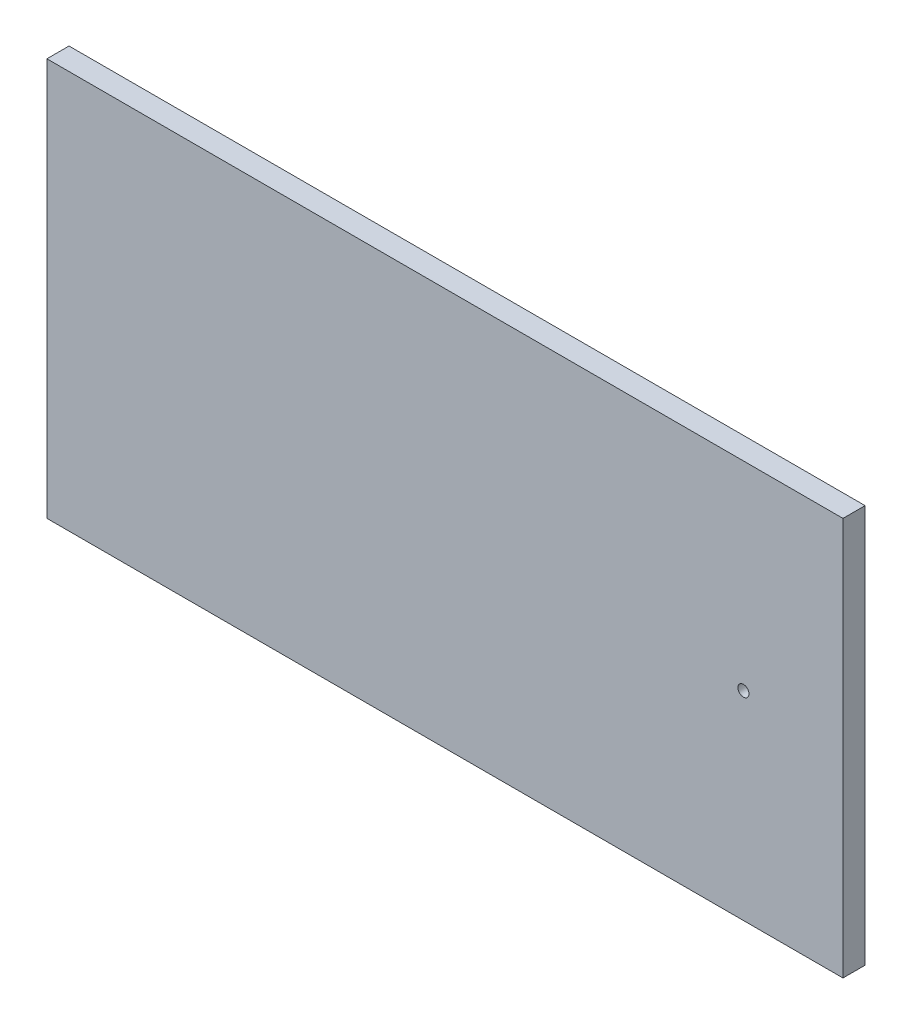
ISO-10303-21;
HEADER;
FILE_DESCRIPTION(('STEP AP214'),'2;1');
FILE_NAME('part.step','',(''),(''),'','','');
FILE_SCHEMA(('AUTOMOTIVE_DESIGN { 1 0 10303 214 1 1 1 1 }'));
ENDSEC;
DATA;
#1=APPLICATION_CONTEXT('core data for automotive mechanical design processes');
#2=APPLICATION_PROTOCOL_DEFINITION('international standard','automotive_design',2000,#1);
#3=PRODUCT_CONTEXT('',#1,'mechanical');
#4=PRODUCT('Part','Part','',(#3));
#5=PRODUCT_RELATED_PRODUCT_CATEGORY('part','',(#4));
#6=PRODUCT_DEFINITION_FORMATION('','',#4);
#7=PRODUCT_DEFINITION_CONTEXT('part definition',#1,'design');
#8=PRODUCT_DEFINITION('design','',#6,#7);
#9=PRODUCT_DEFINITION_SHAPE('','',#8);
#10=(LENGTH_UNIT() NAMED_UNIT(*) SI_UNIT(.MILLI.,.METRE.));
#11=(NAMED_UNIT(*) PLANE_ANGLE_UNIT() SI_UNIT($,.RADIAN.));
#12=(NAMED_UNIT(*) SI_UNIT($,.STERADIAN.) SOLID_ANGLE_UNIT());
#13=UNCERTAINTY_MEASURE_WITH_UNIT(LENGTH_MEASURE(1.E-05),#10,'distance_accuracy_value','');
#14=(GEOMETRIC_REPRESENTATION_CONTEXT(3) GLOBAL_UNCERTAINTY_ASSIGNED_CONTEXT((#13)) GLOBAL_UNIT_ASSIGNED_CONTEXT((#10,
#11,#12)) REPRESENTATION_CONTEXT('',''));
#15=CARTESIAN_POINT('',(0.,0.,0.));
#16=DIRECTION('',(0.,0.,1.));
#17=DIRECTION('',(1.,0.,0.));
#18=AXIS2_PLACEMENT_3D('',#15,#16,#17);
#19=CARTESIAN_POINT('',(0.,0.,12.7));
#20=DIRECTION('',(1.,0.,0.));
#21=DIRECTION('',(0.,1.,0.));
#22=AXIS2_PLACEMENT_3D('',#19,#20,#21);
#23=PLANE('',#22);
#24=DIRECTION('',(0.,-1.,0.));
#25=VECTOR('',#24,1.);
#26=CARTESIAN_POINT('',(0.,0.,0.));
#27=LINE('',#26,#25);
#28=CARTESIAN_POINT('',(0.,0.,0.));
#29=VERTEX_POINT('',#28);
#30=CARTESIAN_POINT('',(0.,-228.6,0.));
#31=VERTEX_POINT('',#30);
#32=EDGE_CURVE('E111',#29,#31,#27,.T.);
#33=ORIENTED_EDGE('',*,*,#32,.T.);
#34=DIRECTION('',(0.,0.,-1.));
#35=VECTOR('',#34,1.);
#36=CARTESIAN_POINT('',(0.,-228.6,12.7));
#37=LINE('',#36,#35);
#38=CARTESIAN_POINT('',(0.,-228.6,12.7));
#39=VERTEX_POINT('',#38);
#40=EDGE_CURVE('E11',#39,#31,#37,.T.);
#41=ORIENTED_EDGE('',*,*,#40,.F.);
#42=DIRECTION('',(0.,-1.,0.));
#43=VECTOR('',#42,1.);
#44=CARTESIAN_POINT('',(0.,0.,12.7));
#45=LINE('',#44,#43);
#46=CARTESIAN_POINT('',(0.,0.,12.7));
#47=VERTEX_POINT('',#46);
#48=EDGE_CURVE('E95',#47,#39,#45,.T.);
#49=ORIENTED_EDGE('',*,*,#48,.F.);
#50=DIRECTION('',(0.,0.,-1.));
#51=VECTOR('',#50,1.);
#52=CARTESIAN_POINT('',(0.,0.,12.7));
#53=LINE('',#52,#51);
#54=EDGE_CURVE('E107',#47,#29,#53,.T.);
#55=ORIENTED_EDGE('',*,*,#54,.T.);
#56=EDGE_LOOP('',(#33,#41,#49,#55));
#57=FACE_BOUND('',#56,.T.);
#58=ADVANCED_FACE('F43',(#57),#23,.F.);
#59=CARTESIAN_POINT('',(0.,-228.6,12.7));
#60=DIRECTION('',(0.,1.,0.));
#61=DIRECTION('',(0.,0.,1.));
#62=AXIS2_PLACEMENT_3D('',#59,#60,#61);
#63=PLANE('',#62);
#64=DIRECTION('',(1.,0.,0.));
#65=VECTOR('',#64,1.);
#66=CARTESIAN_POINT('',(0.,-228.6,0.));
#67=LINE('',#66,#65);
#68=CARTESIAN_POINT('',(457.2,-228.6,0.));
#69=VERTEX_POINT('',#68);
#70=EDGE_CURVE('E100',#31,#69,#67,.T.);
#71=ORIENTED_EDGE('',*,*,#70,.T.);
#72=DIRECTION('',(0.,0.,-1.));
#73=VECTOR('',#72,1.);
#74=CARTESIAN_POINT('',(457.2,-228.6,12.7));
#75=LINE('',#74,#73);
#76=CARTESIAN_POINT('',(457.2,-228.6,12.7));
#77=VERTEX_POINT('',#76);
#78=EDGE_CURVE('E52',#77,#69,#75,.T.);
#79=ORIENTED_EDGE('',*,*,#78,.F.);
#80=DIRECTION('',(1.,0.,0.));
#81=VECTOR('',#80,1.);
#82=CARTESIAN_POINT('',(0.,-228.6,12.7));
#83=LINE('',#82,#81);
#84=EDGE_CURVE('E90',#39,#77,#83,.T.);
#85=ORIENTED_EDGE('',*,*,#84,.F.);
#86=ORIENTED_EDGE('',*,*,#40,.T.);
#87=EDGE_LOOP('',(#71,#79,#85,#86));
#88=FACE_BOUND('',#87,.T.);
#89=ADVANCED_FACE('F99',(#88),#63,.F.);
#90=CARTESIAN_POINT('',(457.2,0.,12.7));
#91=DIRECTION('',(-1.,0.,0.));
#92=DIRECTION('',(0.,-1.,0.));
#93=AXIS2_PLACEMENT_3D('',#90,#91,#92);
#94=PLANE('',#93);
#95=DIRECTION('',(0.,1.,0.));
#96=VECTOR('',#95,1.);
#97=CARTESIAN_POINT('',(457.2,0.,0.));
#98=LINE('',#97,#96);
#99=CARTESIAN_POINT('',(457.2,0.,0.));
#100=VERTEX_POINT('',#99);
#101=EDGE_CURVE('E77',#69,#100,#98,.T.);
#102=ORIENTED_EDGE('',*,*,#101,.T.);
#103=DIRECTION('',(0.,0.,-1.));
#104=VECTOR('',#103,1.);
#105=CARTESIAN_POINT('',(457.2,0.,12.7));
#106=LINE('',#105,#104);
#107=CARTESIAN_POINT('',(457.2,0.,12.7));
#108=VERTEX_POINT('',#107);
#109=EDGE_CURVE('E102',#108,#100,#106,.T.);
#110=ORIENTED_EDGE('',*,*,#109,.F.);
#111=DIRECTION('',(0.,1.,0.));
#112=VECTOR('',#111,1.);
#113=CARTESIAN_POINT('',(457.2,0.,12.7));
#114=LINE('',#113,#112);
#115=EDGE_CURVE('E93',#77,#108,#114,.T.);
#116=ORIENTED_EDGE('',*,*,#115,.F.);
#117=ORIENTED_EDGE('',*,*,#78,.T.);
#118=EDGE_LOOP('',(#102,#110,#116,#117));
#119=FACE_BOUND('',#118,.T.);
#120=ADVANCED_FACE('F103',(#119),#94,.F.);
#121=CARTESIAN_POINT('',(0.,0.,12.7));
#122=DIRECTION('',(0.,-1.,0.));
#123=DIRECTION('',(0.,0.,-1.));
#124=AXIS2_PLACEMENT_3D('',#121,#122,#123);
#125=PLANE('',#124);
#126=DIRECTION('',(-1.,0.,0.));
#127=VECTOR('',#126,1.);
#128=CARTESIAN_POINT('',(0.,0.,0.));
#129=LINE('',#128,#127);
#130=EDGE_CURVE('E83',#100,#29,#129,.T.);
#131=ORIENTED_EDGE('',*,*,#130,.T.);
#132=ORIENTED_EDGE('',*,*,#54,.F.);
#133=DIRECTION('',(-1.,0.,0.));
#134=VECTOR('',#133,1.);
#135=CARTESIAN_POINT('',(0.,0.,12.7));
#136=LINE('',#135,#134);
#137=EDGE_CURVE('E60',#108,#47,#136,.T.);
#138=ORIENTED_EDGE('',*,*,#137,.F.);
#139=ORIENTED_EDGE('',*,*,#109,.T.);
#140=EDGE_LOOP('',(#131,#132,#138,#139));
#141=FACE_BOUND('',#140,.T.);
#142=ADVANCED_FACE('F125',(#141),#125,.F.);
#143=CARTESIAN_POINT('',(0.,0.,12.7));
#144=DIRECTION('',(0.,0.,1.));
#145=DIRECTION('',(1.,0.,0.));
#146=AXIS2_PLACEMENT_3D('',#143,#144,#145);
#147=PLANE('',#146);
#148=CARTESIAN_POINT('',(400.05,-114.3,12.7));
#149=DIRECTION('',(0.,0.,1.));
#150=DIRECTION('',(1.,0.,0.));
#151=AXIS2_PLACEMENT_3D('',#148,#149,#150);
#152=CIRCLE('',#151,3.17499999999991);
#153=CARTESIAN_POINT('',(403.225,-114.3,12.7));
#154=VERTEX_POINT('',#153);
#155=EDGE_CURVE('E132',#154,#154,#152,.T.);
#156=ORIENTED_EDGE('',*,*,#155,.F.);
#157=EDGE_LOOP('',(#156));
#158=FACE_BOUND('',#157,.T.);
#159=ORIENTED_EDGE('',*,*,#48,.T.);
#160=ORIENTED_EDGE('',*,*,#84,.T.);
#161=ORIENTED_EDGE('',*,*,#115,.T.);
#162=ORIENTED_EDGE('',*,*,#137,.T.);
#163=EDGE_LOOP('',(#159,#160,#161,#162));
#164=FACE_BOUND('',#163,.T.);
#165=ADVANCED_FACE('F91',(#158,#164),#147,.T.);
#166=CARTESIAN_POINT('',(0.,0.,0.));
#167=DIRECTION('',(0.,0.,1.));
#168=DIRECTION('',(1.,0.,0.));
#169=AXIS2_PLACEMENT_3D('',#166,#167,#168);
#170=PLANE('',#169);
#171=CARTESIAN_POINT('',(400.05,-114.3,0.));
#172=DIRECTION('',(0.,0.,1.));
#173=DIRECTION('',(1.,0.,0.));
#174=AXIS2_PLACEMENT_3D('',#171,#172,#173);
#175=CIRCLE('',#174,3.17499999999991);
#176=CARTESIAN_POINT('',(403.225,-114.3,0.));
#177=VERTEX_POINT('',#176);
#178=EDGE_CURVE('E115',#177,#177,#175,.T.);
#179=ORIENTED_EDGE('',*,*,#178,.T.);
#180=EDGE_LOOP('',(#179));
#181=FACE_BOUND('',#180,.T.);
#182=ORIENTED_EDGE('',*,*,#32,.F.);
#183=ORIENTED_EDGE('',*,*,#130,.F.);
#184=ORIENTED_EDGE('',*,*,#101,.F.);
#185=ORIENTED_EDGE('',*,*,#70,.F.);
#186=EDGE_LOOP('',(#182,#183,#184,#185));
#187=FACE_BOUND('',#186,.T.);
#188=ADVANCED_FACE('F128',(#181,#187),#170,.F.);
#189=CARTESIAN_POINT('',(400.05,-114.3,0.));
#190=DIRECTION('',(0.,0.,1.));
#191=DIRECTION('',(1.,0.,0.));
#192=AXIS2_PLACEMENT_3D('',#189,#190,#191);
#193=CYLINDRICAL_SURFACE('',#192,3.17499999999991);
#194=ORIENTED_EDGE('',*,*,#178,.F.);
#195=EDGE_LOOP('',(#194));
#196=FACE_BOUND('',#195,.T.);
#197=ORIENTED_EDGE('',*,*,#155,.T.);
#198=EDGE_LOOP('',(#197));
#199=FACE_BOUND('',#198,.T.);
#200=ADVANCED_FACE('F141',(#196,#199),#193,.F.);
#201=CLOSED_SHELL('',(#58,#89,#120,#142,#165,#188,#200));
#202=MANIFOLD_SOLID_BREP('B2',#201);
#203=ADVANCED_BREP_SHAPE_REPRESENTATION('',(#18,#202),#14);
#204=SHAPE_DEFINITION_REPRESENTATION(#9,#203);
ENDSEC;
END-ISO-10303-21;
